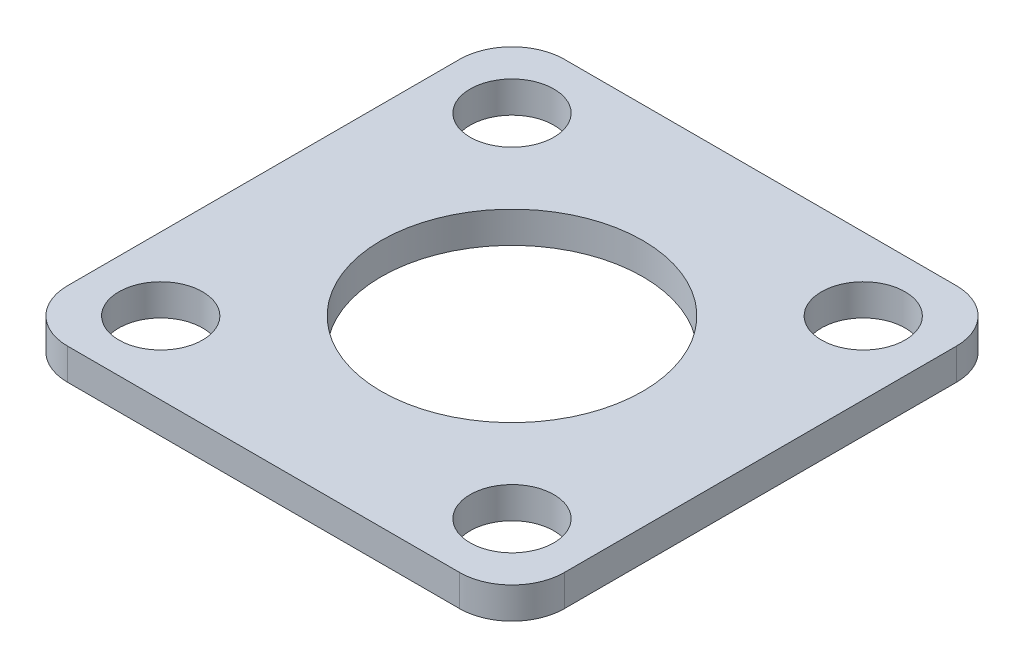
ISO-10303-21;
HEADER;
FILE_DESCRIPTION(('STEP AP214'),'2;1');
FILE_NAME('part.step','',(''),(''),'','','');
FILE_SCHEMA(('AUTOMOTIVE_DESIGN { 1 0 10303 214 1 1 1 1 }'));
ENDSEC;
DATA;
#1=APPLICATION_CONTEXT('core data for automotive mechanical design processes');
#2=APPLICATION_PROTOCOL_DEFINITION('international standard','automotive_design',2000,#1);
#3=PRODUCT_CONTEXT('',#1,'mechanical');
#4=PRODUCT('Part','Part','',(#3));
#5=PRODUCT_RELATED_PRODUCT_CATEGORY('part','',(#4));
#6=PRODUCT_DEFINITION_FORMATION('','',#4);
#7=PRODUCT_DEFINITION_CONTEXT('part definition',#1,'design');
#8=PRODUCT_DEFINITION('design','',#6,#7);
#9=PRODUCT_DEFINITION_SHAPE('','',#8);
#10=(LENGTH_UNIT() NAMED_UNIT(*) SI_UNIT(.MILLI.,.METRE.));
#11=(NAMED_UNIT(*) PLANE_ANGLE_UNIT() SI_UNIT($,.RADIAN.));
#12=(NAMED_UNIT(*) SI_UNIT($,.STERADIAN.) SOLID_ANGLE_UNIT());
#13=UNCERTAINTY_MEASURE_WITH_UNIT(LENGTH_MEASURE(1.E-05),#10,'distance_accuracy_value','');
#14=(GEOMETRIC_REPRESENTATION_CONTEXT(3) GLOBAL_UNCERTAINTY_ASSIGNED_CONTEXT((#13)) GLOBAL_UNIT_ASSIGNED_CONTEXT((#10,
#11,#12)) REPRESENTATION_CONTEXT('',''));
#15=CARTESIAN_POINT('',(0.,0.,0.));
#16=DIRECTION('',(0.,0.,1.));
#17=DIRECTION('',(1.,0.,0.));
#18=AXIS2_PLACEMENT_3D('',#15,#16,#17);
#19=CARTESIAN_POINT('',(0.,1.2,0.));
#20=DIRECTION('',(0.,1.,0.));
#21=DIRECTION('',(0.,0.,1.));
#22=AXIS2_PLACEMENT_3D('',#19,#20,#21);
#23=PLANE('',#22);
#24=CARTESIAN_POINT('',(-6.71751442127217,1.2,-6.71751442127224));
#25=DIRECTION('',(0.,1.,0.));
#26=DIRECTION('',(0.,0.,1.));
#27=AXIS2_PLACEMENT_3D('',#24,#25,#26);
#28=CIRCLE('',#27,1.6);
#29=CARTESIAN_POINT('',(-6.71751442127217,1.2,-5.11751442127224));
#30=VERTEX_POINT('',#29);
#31=EDGE_CURVE('E198',#30,#30,#28,.T.);
#32=ORIENTED_EDGE('',*,*,#31,.F.);
#33=EDGE_LOOP('',(#32));
#34=FACE_BOUND('',#33,.T.);
#35=CARTESIAN_POINT('',(6.71751442127221,1.2,6.71751442127219));
#36=DIRECTION('',(0.,1.,0.));
#37=DIRECTION('',(0.,0.,1.));
#38=AXIS2_PLACEMENT_3D('',#35,#36,#37);
#39=CIRCLE('',#38,1.6);
#40=CARTESIAN_POINT('',(6.71751442127221,1.2,8.31751442127219));
#41=VERTEX_POINT('',#40);
#42=EDGE_CURVE('E187',#41,#41,#39,.T.);
#43=ORIENTED_EDGE('',*,*,#42,.F.);
#44=EDGE_LOOP('',(#43));
#45=FACE_BOUND('',#44,.T.);
#46=DIRECTION('',(-1.,0.,0.));
#47=VECTOR('',#46,1.);
#48=CARTESIAN_POINT('',(-9.5,1.2,-9.5));
#49=LINE('',#48,#47);
#50=CARTESIAN_POINT('',(7.5,1.2,-9.5));
#51=VERTEX_POINT('',#50);
#52=CARTESIAN_POINT('',(-7.5,1.2,-9.5));
#53=VERTEX_POINT('',#52);
#54=EDGE_CURVE('E139',#51,#53,#49,.T.);
#55=ORIENTED_EDGE('',*,*,#54,.T.);
#56=CARTESIAN_POINT('',(-7.5,1.2,-7.5));
#57=DIRECTION('',(0.,1.,0.));
#58=DIRECTION('',(0.,0.,1.));
#59=AXIS2_PLACEMENT_3D('',#56,#57,#58);
#60=CIRCLE('',#59,2.);
#61=CARTESIAN_POINT('',(-9.5,1.2,-7.5));
#62=VERTEX_POINT('',#61);
#63=EDGE_CURVE('E157',#53,#62,#60,.T.);
#64=ORIENTED_EDGE('',*,*,#63,.T.);
#65=DIRECTION('',(0.,0.,1.));
#66=VECTOR('',#65,1.);
#67=CARTESIAN_POINT('',(-9.5,1.2,-9.5));
#68=LINE('',#67,#66);
#69=CARTESIAN_POINT('',(-9.5,1.2,7.5));
#70=VERTEX_POINT('',#69);
#71=EDGE_CURVE('E121',#62,#70,#68,.T.);
#72=ORIENTED_EDGE('',*,*,#71,.T.);
#73=CARTESIAN_POINT('',(-7.5,1.2,7.5));
#74=DIRECTION('',(0.,1.,0.));
#75=DIRECTION('',(0.,0.,1.));
#76=AXIS2_PLACEMENT_3D('',#73,#74,#75);
#77=CIRCLE('',#76,2.);
#78=CARTESIAN_POINT('',(-7.5,1.2,9.5));
#79=VERTEX_POINT('',#78);
#80=EDGE_CURVE('E153',#70,#79,#77,.T.);
#81=ORIENTED_EDGE('',*,*,#80,.T.);
#82=DIRECTION('',(1.,0.,0.));
#83=VECTOR('',#82,1.);
#84=CARTESIAN_POINT('',(-9.5,1.2,9.5));
#85=LINE('',#84,#83);
#86=CARTESIAN_POINT('',(7.5,1.2,9.5));
#87=VERTEX_POINT('',#86);
#88=EDGE_CURVE('E166',#79,#87,#85,.T.);
#89=ORIENTED_EDGE('',*,*,#88,.T.);
#90=CARTESIAN_POINT('',(7.5,1.2,7.5));
#91=DIRECTION('',(0.,1.,0.));
#92=DIRECTION('',(0.,0.,1.));
#93=AXIS2_PLACEMENT_3D('',#90,#91,#92);
#94=CIRCLE('',#93,2.);
#95=CARTESIAN_POINT('',(9.5,1.2,7.5));
#96=VERTEX_POINT('',#95);
#97=EDGE_CURVE('E56',#87,#96,#94,.T.);
#98=ORIENTED_EDGE('',*,*,#97,.T.);
#99=DIRECTION('',(0.,0.,-1.));
#100=VECTOR('',#99,1.);
#101=CARTESIAN_POINT('',(9.5,1.2,-9.5));
#102=LINE('',#101,#100);
#103=CARTESIAN_POINT('',(9.5,1.2,-7.5));
#104=VERTEX_POINT('',#103);
#105=EDGE_CURVE('E172',#96,#104,#102,.T.);
#106=ORIENTED_EDGE('',*,*,#105,.T.);
#107=CARTESIAN_POINT('',(7.5,1.2,-7.5));
#108=DIRECTION('',(0.,1.,0.));
#109=DIRECTION('',(0.,0.,1.));
#110=AXIS2_PLACEMENT_3D('',#107,#108,#109);
#111=CIRCLE('',#110,2.);
#112=EDGE_CURVE('E155',#104,#51,#111,.T.);
#113=ORIENTED_EDGE('',*,*,#112,.T.);
#114=EDGE_LOOP('',(#55,#64,#72,#81,#89,#98,#106,#113));
#115=FACE_BOUND('',#114,.T.);
#116=CARTESIAN_POINT('',(0.,1.2,0.));
#117=DIRECTION('',(0.,1.,0.));
#118=DIRECTION('',(0.,0.,1.));
#119=AXIS2_PLACEMENT_3D('',#116,#117,#118);
#120=CIRCLE('',#119,5.);
#121=CARTESIAN_POINT('',(0.,1.2,5.));
#122=VERTEX_POINT('',#121);
#123=EDGE_CURVE('E130',#122,#122,#120,.T.);
#124=ORIENTED_EDGE('',*,*,#123,.F.);
#125=EDGE_LOOP('',(#124));
#126=FACE_BOUND('',#125,.T.);
#127=CARTESIAN_POINT('',(-6.71751442127219,1.2,6.71751442127217));
#128=DIRECTION('',(0.,1.,0.));
#129=DIRECTION('',(0.,0.,1.));
#130=AXIS2_PLACEMENT_3D('',#127,#128,#129);
#131=CIRCLE('',#130,1.6);
#132=CARTESIAN_POINT('',(-6.71751442127219,1.2,8.31751442127217));
#133=VERTEX_POINT('',#132);
#134=EDGE_CURVE('E192',#133,#133,#131,.T.);
#135=ORIENTED_EDGE('',*,*,#134,.F.);
#136=EDGE_LOOP('',(#135));
#137=FACE_BOUND('',#136,.T.);
#138=CARTESIAN_POINT('',(6.71751442127224,1.2,-6.71751442127221));
#139=DIRECTION('',(0.,1.,0.));
#140=DIRECTION('',(0.,0.,1.));
#141=AXIS2_PLACEMENT_3D('',#138,#139,#140);
#142=CIRCLE('',#141,1.6);
#143=CARTESIAN_POINT('',(6.71751442127224,1.2,-5.11751442127221));
#144=VERTEX_POINT('',#143);
#145=EDGE_CURVE('E204',#144,#144,#142,.T.);
#146=ORIENTED_EDGE('',*,*,#145,.F.);
#147=EDGE_LOOP('',(#146));
#148=FACE_BOUND('',#147,.T.);
#149=ADVANCED_FACE('F34',(#34,#45,#115,#126,#137,#148),#23,.T.);
#150=CARTESIAN_POINT('',(0.,0.,0.));
#151=DIRECTION('',(0.,1.,0.));
#152=DIRECTION('',(0.,0.,1.));
#153=AXIS2_PLACEMENT_3D('',#150,#151,#152);
#154=PLANE('',#153);
#155=DIRECTION('',(0.,0.,1.));
#156=VECTOR('',#155,1.);
#157=CARTESIAN_POINT('',(-9.5,0.,-9.5));
#158=LINE('',#157,#156);
#159=CARTESIAN_POINT('',(-9.5,0.,-7.5));
#160=VERTEX_POINT('',#159);
#161=CARTESIAN_POINT('',(-9.5,0.,7.5));
#162=VERTEX_POINT('',#161);
#163=EDGE_CURVE('E118',#160,#162,#158,.T.);
#164=ORIENTED_EDGE('',*,*,#163,.F.);
#165=CARTESIAN_POINT('',(-7.5,0.,-7.5));
#166=DIRECTION('',(0.,1.,0.));
#167=DIRECTION('',(0.,0.,1.));
#168=AXIS2_PLACEMENT_3D('',#165,#166,#167);
#169=CIRCLE('',#168,2.);
#170=CARTESIAN_POINT('',(-7.5,0.,-9.5));
#171=VERTEX_POINT('',#170);
#172=EDGE_CURVE('E101',#160,#171,#169,.F.);
#173=ORIENTED_EDGE('',*,*,#172,.T.);
#174=DIRECTION('',(-1.,0.,0.));
#175=VECTOR('',#174,1.);
#176=CARTESIAN_POINT('',(-9.5,0.,-9.5));
#177=LINE('',#176,#175);
#178=CARTESIAN_POINT('',(7.5,0.,-9.5));
#179=VERTEX_POINT('',#178);
#180=EDGE_CURVE('E143',#179,#171,#177,.T.);
#181=ORIENTED_EDGE('',*,*,#180,.F.);
#182=CARTESIAN_POINT('',(7.5,0.,-7.5));
#183=DIRECTION('',(0.,1.,0.));
#184=DIRECTION('',(0.,0.,1.));
#185=AXIS2_PLACEMENT_3D('',#182,#183,#184);
#186=CIRCLE('',#185,2.);
#187=CARTESIAN_POINT('',(9.5,0.,-7.5));
#188=VERTEX_POINT('',#187);
#189=EDGE_CURVE('E112',#179,#188,#186,.F.);
#190=ORIENTED_EDGE('',*,*,#189,.T.);
#191=DIRECTION('',(0.,0.,-1.));
#192=VECTOR('',#191,1.);
#193=CARTESIAN_POINT('',(9.5,0.,-9.5));
#194=LINE('',#193,#192);
#195=CARTESIAN_POINT('',(9.5,0.,7.5));
#196=VERTEX_POINT('',#195);
#197=EDGE_CURVE('E133',#196,#188,#194,.T.);
#198=ORIENTED_EDGE('',*,*,#197,.F.);
#199=CARTESIAN_POINT('',(7.5,0.,7.5));
#200=DIRECTION('',(0.,1.,0.));
#201=DIRECTION('',(0.,0.,1.));
#202=AXIS2_PLACEMENT_3D('',#199,#200,#201);
#203=CIRCLE('',#202,2.);
#204=CARTESIAN_POINT('',(7.5,0.,9.5));
#205=VERTEX_POINT('',#204);
#206=EDGE_CURVE('E122',#196,#205,#203,.F.);
#207=ORIENTED_EDGE('',*,*,#206,.T.);
#208=DIRECTION('',(1.,0.,0.));
#209=VECTOR('',#208,1.);
#210=CARTESIAN_POINT('',(-9.5,0.,9.5));
#211=LINE('',#210,#209);
#212=CARTESIAN_POINT('',(-7.5,0.,9.5));
#213=VERTEX_POINT('',#212);
#214=EDGE_CURVE('E129',#213,#205,#211,.T.);
#215=ORIENTED_EDGE('',*,*,#214,.F.);
#216=CARTESIAN_POINT('',(-7.5,0.,7.5));
#217=DIRECTION('',(0.,1.,0.));
#218=DIRECTION('',(0.,0.,1.));
#219=AXIS2_PLACEMENT_3D('',#216,#217,#218);
#220=CIRCLE('',#219,2.);
#221=EDGE_CURVE('E128',#213,#162,#220,.F.);
#222=ORIENTED_EDGE('',*,*,#221,.T.);
#223=EDGE_LOOP('',(#164,#173,#181,#190,#198,#207,#215,#222));
#224=FACE_BOUND('',#223,.T.);
#225=CARTESIAN_POINT('',(0.,0.,0.));
#226=DIRECTION('',(0.,1.,0.));
#227=DIRECTION('',(0.,0.,1.));
#228=AXIS2_PLACEMENT_3D('',#225,#226,#227);
#229=CIRCLE('',#228,5.);
#230=CARTESIAN_POINT('',(0.,0.,5.));
#231=VERTEX_POINT('',#230);
#232=EDGE_CURVE('E136',#231,#231,#229,.T.);
#233=ORIENTED_EDGE('',*,*,#232,.T.);
#234=EDGE_LOOP('',(#233));
#235=FACE_BOUND('',#234,.T.);
#236=CARTESIAN_POINT('',(6.71751442127221,0.,6.71751442127219));
#237=DIRECTION('',(0.,1.,0.));
#238=DIRECTION('',(0.,0.,1.));
#239=AXIS2_PLACEMENT_3D('',#236,#237,#238);
#240=CIRCLE('',#239,1.6);
#241=CARTESIAN_POINT('',(6.71751442127221,0.,8.31751442127219));
#242=VERTEX_POINT('',#241);
#243=EDGE_CURVE('E189',#242,#242,#240,.T.);
#244=ORIENTED_EDGE('',*,*,#243,.T.);
#245=EDGE_LOOP('',(#244));
#246=FACE_BOUND('',#245,.T.);
#247=CARTESIAN_POINT('',(-6.71751442127219,0.,6.71751442127217));
#248=DIRECTION('',(0.,1.,0.));
#249=DIRECTION('',(0.,0.,1.));
#250=AXIS2_PLACEMENT_3D('',#247,#248,#249);
#251=CIRCLE('',#250,1.6);
#252=CARTESIAN_POINT('',(-6.71751442127219,0.,8.31751442127217));
#253=VERTEX_POINT('',#252);
#254=EDGE_CURVE('E195',#253,#253,#251,.T.);
#255=ORIENTED_EDGE('',*,*,#254,.T.);
#256=EDGE_LOOP('',(#255));
#257=FACE_BOUND('',#256,.T.);
#258=CARTESIAN_POINT('',(-6.71751442127217,0.,-6.71751442127224));
#259=DIRECTION('',(0.,1.,0.));
#260=DIRECTION('',(0.,0.,1.));
#261=AXIS2_PLACEMENT_3D('',#258,#259,#260);
#262=CIRCLE('',#261,1.6);
#263=CARTESIAN_POINT('',(-6.71751442127217,0.,-5.11751442127224));
#264=VERTEX_POINT('',#263);
#265=EDGE_CURVE('E201',#264,#264,#262,.T.);
#266=ORIENTED_EDGE('',*,*,#265,.T.);
#267=EDGE_LOOP('',(#266));
#268=FACE_BOUND('',#267,.T.);
#269=CARTESIAN_POINT('',(6.71751442127224,0.,-6.71751442127221));
#270=DIRECTION('',(0.,1.,0.));
#271=DIRECTION('',(0.,0.,1.));
#272=AXIS2_PLACEMENT_3D('',#269,#270,#271);
#273=CIRCLE('',#272,1.6);
#274=CARTESIAN_POINT('',(6.71751442127224,0.,-5.11751442127221));
#275=VERTEX_POINT('',#274);
#276=EDGE_CURVE('E207',#275,#275,#273,.T.);
#277=ORIENTED_EDGE('',*,*,#276,.T.);
#278=EDGE_LOOP('',(#277));
#279=FACE_BOUND('',#278,.T.);
#280=ADVANCED_FACE('F125',(#224,#235,#246,#257,#268,#279),#154,.F.);
#281=CARTESIAN_POINT('',(-9.5,1.2,-9.5));
#282=DIRECTION('',(1.,0.,0.));
#283=DIRECTION('',(0.,0.,-1.));
#284=AXIS2_PLACEMENT_3D('',#281,#282,#283);
#285=PLANE('',#284);
#286=ORIENTED_EDGE('',*,*,#71,.F.);
#287=DIRECTION('',(0.,-1.,0.));
#288=VECTOR('',#287,1.);
#289=CARTESIAN_POINT('',(-9.5,1.2,-7.5));
#290=LINE('',#289,#288);
#291=EDGE_CURVE('E105',#62,#160,#290,.T.);
#292=ORIENTED_EDGE('',*,*,#291,.T.);
#293=ORIENTED_EDGE('',*,*,#163,.T.);
#294=DIRECTION('',(0.,-1.,0.));
#295=VECTOR('',#294,1.);
#296=CARTESIAN_POINT('',(-9.5,1.2,7.5));
#297=LINE('',#296,#295);
#298=EDGE_CURVE('E123',#162,#70,#297,.F.);
#299=ORIENTED_EDGE('',*,*,#298,.T.);
#300=EDGE_LOOP('',(#286,#292,#293,#299));
#301=FACE_BOUND('',#300,.T.);
#302=ADVANCED_FACE('F117',(#301),#285,.F.);
#303=CARTESIAN_POINT('',(-9.5,1.2,9.5));
#304=DIRECTION('',(0.,0.,-1.));
#305=DIRECTION('',(-1.,0.,0.));
#306=AXIS2_PLACEMENT_3D('',#303,#304,#305);
#307=PLANE('',#306);
#308=ORIENTED_EDGE('',*,*,#88,.F.);
#309=DIRECTION('',(0.,-1.,0.));
#310=VECTOR('',#309,1.);
#311=CARTESIAN_POINT('',(-7.5,1.2,9.5));
#312=LINE('',#311,#310);
#313=EDGE_CURVE('E11',#79,#213,#312,.T.);
#314=ORIENTED_EDGE('',*,*,#313,.T.);
#315=ORIENTED_EDGE('',*,*,#214,.T.);
#316=DIRECTION('',(0.,-1.,0.));
#317=VECTOR('',#316,1.);
#318=CARTESIAN_POINT('',(7.5,1.2,9.5));
#319=LINE('',#318,#317);
#320=EDGE_CURVE('E42',#205,#87,#319,.F.);
#321=ORIENTED_EDGE('',*,*,#320,.T.);
#322=EDGE_LOOP('',(#308,#314,#315,#321));
#323=FACE_BOUND('',#322,.T.);
#324=ADVANCED_FACE('F165',(#323),#307,.F.);
#325=CARTESIAN_POINT('',(9.5,1.2,-9.5));
#326=DIRECTION('',(-1.,0.,0.));
#327=DIRECTION('',(0.,0.,1.));
#328=AXIS2_PLACEMENT_3D('',#325,#326,#327);
#329=PLANE('',#328);
#330=ORIENTED_EDGE('',*,*,#197,.T.);
#331=DIRECTION('',(0.,-1.,0.));
#332=VECTOR('',#331,1.);
#333=CARTESIAN_POINT('',(9.5,1.2,-7.5));
#334=LINE('',#333,#332);
#335=EDGE_CURVE('E49',#188,#104,#334,.F.);
#336=ORIENTED_EDGE('',*,*,#335,.T.);
#337=ORIENTED_EDGE('',*,*,#105,.F.);
#338=DIRECTION('',(0.,-1.,0.));
#339=VECTOR('',#338,1.);
#340=CARTESIAN_POINT('',(9.5,1.2,7.5));
#341=LINE('',#340,#339);
#342=EDGE_CURVE('E159',#96,#196,#341,.T.);
#343=ORIENTED_EDGE('',*,*,#342,.T.);
#344=EDGE_LOOP('',(#330,#336,#337,#343));
#345=FACE_BOUND('',#344,.T.);
#346=ADVANCED_FACE('F176',(#345),#329,.F.);
#347=CARTESIAN_POINT('',(-9.5,1.2,-9.5));
#348=DIRECTION('',(0.,0.,1.));
#349=DIRECTION('',(1.,0.,0.));
#350=AXIS2_PLACEMENT_3D('',#347,#348,#349);
#351=PLANE('',#350);
#352=ORIENTED_EDGE('',*,*,#180,.T.);
#353=DIRECTION('',(0.,-1.,0.));
#354=VECTOR('',#353,1.);
#355=CARTESIAN_POINT('',(-7.5,1.2,-9.5));
#356=LINE('',#355,#354);
#357=EDGE_CURVE('E106',#171,#53,#356,.F.);
#358=ORIENTED_EDGE('',*,*,#357,.T.);
#359=ORIENTED_EDGE('',*,*,#54,.F.);
#360=DIRECTION('',(0.,-1.,0.));
#361=VECTOR('',#360,1.);
#362=CARTESIAN_POINT('',(7.5,1.2,-9.5));
#363=LINE('',#362,#361);
#364=EDGE_CURVE('E111',#51,#179,#363,.T.);
#365=ORIENTED_EDGE('',*,*,#364,.T.);
#366=EDGE_LOOP('',(#352,#358,#359,#365));
#367=FACE_BOUND('',#366,.T.);
#368=ADVANCED_FACE('F183',(#367),#351,.F.);
#369=CARTESIAN_POINT('',(0.,1.2,0.));
#370=DIRECTION('',(0.,-1.,0.));
#371=DIRECTION('',(0.,0.,-1.));
#372=AXIS2_PLACEMENT_3D('',#369,#370,#371);
#373=CYLINDRICAL_SURFACE('',#372,5.);
#374=ORIENTED_EDGE('',*,*,#123,.T.);
#375=EDGE_LOOP('',(#374));
#376=FACE_BOUND('',#375,.T.);
#377=ORIENTED_EDGE('',*,*,#232,.F.);
#378=EDGE_LOOP('',(#377));
#379=FACE_BOUND('',#378,.T.);
#380=ADVANCED_FACE('F226',(#376,#379),#373,.F.);
#381=CARTESIAN_POINT('',(6.71751442127221,1.2,6.71751442127219));
#382=DIRECTION('',(0.,-1.,0.));
#383=DIRECTION('',(0.,0.,-1.));
#384=AXIS2_PLACEMENT_3D('',#381,#382,#383);
#385=CYLINDRICAL_SURFACE('',#384,1.6);
#386=ORIENTED_EDGE('',*,*,#42,.T.);
#387=EDGE_LOOP('',(#386));
#388=FACE_BOUND('',#387,.T.);
#389=ORIENTED_EDGE('',*,*,#243,.F.);
#390=EDGE_LOOP('',(#389));
#391=FACE_BOUND('',#390,.T.);
#392=ADVANCED_FACE('F328',(#388,#391),#385,.F.);
#393=CARTESIAN_POINT('',(-6.71751442127219,1.2,6.71751442127217));
#394=DIRECTION('',(0.,-1.,0.));
#395=DIRECTION('',(0.,0.,-1.));
#396=AXIS2_PLACEMENT_3D('',#393,#394,#395);
#397=CYLINDRICAL_SURFACE('',#396,1.6);
#398=ORIENTED_EDGE('',*,*,#134,.T.);
#399=EDGE_LOOP('',(#398));
#400=FACE_BOUND('',#399,.T.);
#401=ORIENTED_EDGE('',*,*,#254,.F.);
#402=EDGE_LOOP('',(#401));
#403=FACE_BOUND('',#402,.T.);
#404=ADVANCED_FACE('F318',(#400,#403),#397,.F.);
#405=CARTESIAN_POINT('',(-6.71751442127217,1.2,-6.71751442127224));
#406=DIRECTION('',(0.,-1.,0.));
#407=DIRECTION('',(0.,0.,-1.));
#408=AXIS2_PLACEMENT_3D('',#405,#406,#407);
#409=CYLINDRICAL_SURFACE('',#408,1.6);
#410=ORIENTED_EDGE('',*,*,#31,.T.);
#411=EDGE_LOOP('',(#410));
#412=FACE_BOUND('',#411,.T.);
#413=ORIENTED_EDGE('',*,*,#265,.F.);
#414=EDGE_LOOP('',(#413));
#415=FACE_BOUND('',#414,.T.);
#416=ADVANCED_FACE('F309',(#412,#415),#409,.F.);
#417=CARTESIAN_POINT('',(6.71751442127224,1.2,-6.71751442127221));
#418=DIRECTION('',(0.,-1.,0.));
#419=DIRECTION('',(0.,0.,-1.));
#420=AXIS2_PLACEMENT_3D('',#417,#418,#419);
#421=CYLINDRICAL_SURFACE('',#420,1.6);
#422=ORIENTED_EDGE('',*,*,#145,.T.);
#423=EDGE_LOOP('',(#422));
#424=FACE_BOUND('',#423,.T.);
#425=ORIENTED_EDGE('',*,*,#276,.F.);
#426=EDGE_LOOP('',(#425));
#427=FACE_BOUND('',#426,.T.);
#428=ADVANCED_FACE('F213',(#424,#427),#421,.F.);
#429=CARTESIAN_POINT('',(-7.5,1.2,-7.5));
#430=DIRECTION('',(0.,-1.,0.));
#431=DIRECTION('',(0.,0.,-1.));
#432=AXIS2_PLACEMENT_3D('',#429,#430,#431);
#433=CYLINDRICAL_SURFACE('',#432,2.);
#434=ORIENTED_EDGE('',*,*,#63,.F.);
#435=ORIENTED_EDGE('',*,*,#357,.F.);
#436=ORIENTED_EDGE('',*,*,#172,.F.);
#437=ORIENTED_EDGE('',*,*,#291,.F.);
#438=EDGE_LOOP('',(#434,#435,#436,#437));
#439=FACE_BOUND('',#438,.T.);
#440=ADVANCED_FACE('F104',(#439),#433,.T.);
#441=CARTESIAN_POINT('',(7.5,1.2,-7.5));
#442=DIRECTION('',(0.,-1.,0.));
#443=DIRECTION('',(0.,0.,-1.));
#444=AXIS2_PLACEMENT_3D('',#441,#442,#443);
#445=CYLINDRICAL_SURFACE('',#444,2.);
#446=ORIENTED_EDGE('',*,*,#112,.F.);
#447=ORIENTED_EDGE('',*,*,#335,.F.);
#448=ORIENTED_EDGE('',*,*,#189,.F.);
#449=ORIENTED_EDGE('',*,*,#364,.F.);
#450=EDGE_LOOP('',(#446,#447,#448,#449));
#451=FACE_BOUND('',#450,.T.);
#452=ADVANCED_FACE('F180',(#451),#445,.T.);
#453=CARTESIAN_POINT('',(-7.5,1.2,7.5));
#454=DIRECTION('',(0.,-1.,0.));
#455=DIRECTION('',(0.,0.,-1.));
#456=AXIS2_PLACEMENT_3D('',#453,#454,#455);
#457=CYLINDRICAL_SURFACE('',#456,2.);
#458=ORIENTED_EDGE('',*,*,#80,.F.);
#459=ORIENTED_EDGE('',*,*,#298,.F.);
#460=ORIENTED_EDGE('',*,*,#221,.F.);
#461=ORIENTED_EDGE('',*,*,#313,.F.);
#462=EDGE_LOOP('',(#458,#459,#460,#461));
#463=FACE_BOUND('',#462,.T.);
#464=ADVANCED_FACE('F240',(#463),#457,.T.);
#465=CARTESIAN_POINT('',(7.5,1.2,7.5));
#466=DIRECTION('',(0.,-1.,0.));
#467=DIRECTION('',(0.,0.,-1.));
#468=AXIS2_PLACEMENT_3D('',#465,#466,#467);
#469=CYLINDRICAL_SURFACE('',#468,2.);
#470=ORIENTED_EDGE('',*,*,#97,.F.);
#471=ORIENTED_EDGE('',*,*,#320,.F.);
#472=ORIENTED_EDGE('',*,*,#206,.F.);
#473=ORIENTED_EDGE('',*,*,#342,.F.);
#474=EDGE_LOOP('',(#470,#471,#472,#473));
#475=FACE_BOUND('',#474,.T.);
#476=ADVANCED_FACE('F36',(#475),#469,.T.);
#477=CLOSED_SHELL('',(#149,#280,#302,#324,#346,#368,#380,#392,#404,#416,#428,#440,#452,#464,#476));
#478=MANIFOLD_SOLID_BREP('B2',#477);
#479=ADVANCED_BREP_SHAPE_REPRESENTATION('',(#18,#478),#14);
#480=SHAPE_DEFINITION_REPRESENTATION(#9,#479);
ENDSEC;
END-ISO-10303-21;
